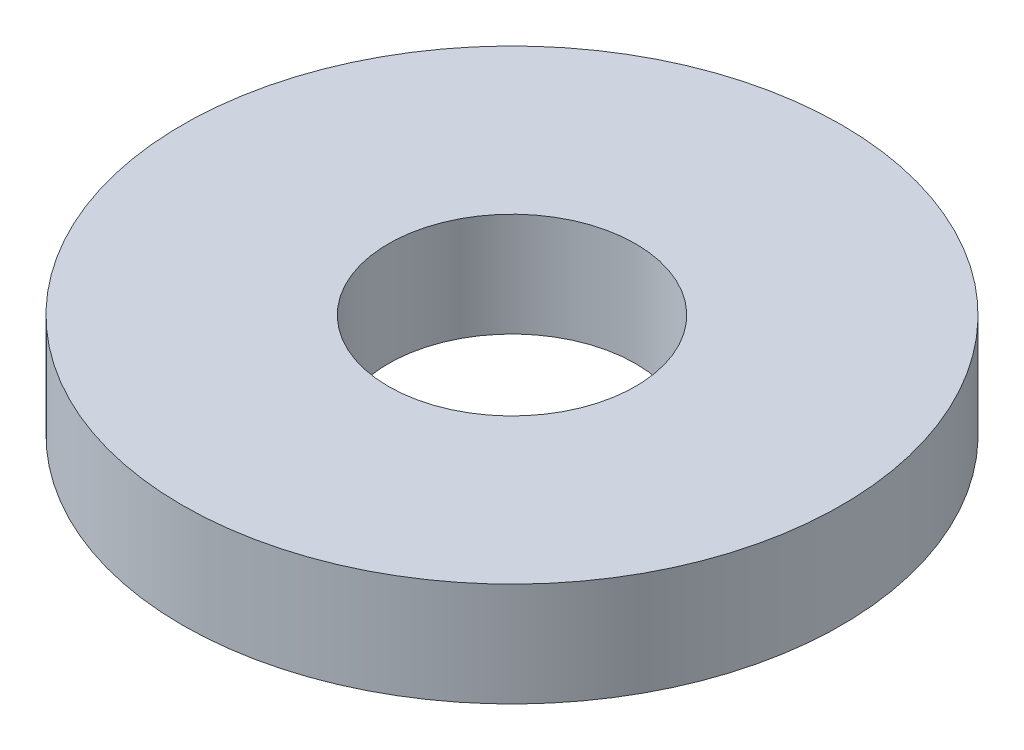
ISO-10303-21;
HEADER;
FILE_DESCRIPTION(('STEP AP214'),'2;1');
FILE_NAME('part.step','',(''),(''),'','','');
FILE_SCHEMA(('AUTOMOTIVE_DESIGN { 1 0 10303 214 1 1 1 1 }'));
ENDSEC;
DATA;
#1=APPLICATION_CONTEXT('core data for automotive mechanical design processes');
#2=APPLICATION_PROTOCOL_DEFINITION('international standard','automotive_design',2000,#1);
#3=PRODUCT_CONTEXT('',#1,'mechanical');
#4=PRODUCT('Part','Part','',(#3));
#5=PRODUCT_RELATED_PRODUCT_CATEGORY('part','',(#4));
#6=PRODUCT_DEFINITION_FORMATION('','',#4);
#7=PRODUCT_DEFINITION_CONTEXT('part definition',#1,'design');
#8=PRODUCT_DEFINITION('design','',#6,#7);
#9=PRODUCT_DEFINITION_SHAPE('','',#8);
#10=(LENGTH_UNIT() NAMED_UNIT(*) SI_UNIT(.MILLI.,.METRE.));
#11=(NAMED_UNIT(*) PLANE_ANGLE_UNIT() SI_UNIT($,.RADIAN.));
#12=(NAMED_UNIT(*) SI_UNIT($,.STERADIAN.) SOLID_ANGLE_UNIT());
#13=UNCERTAINTY_MEASURE_WITH_UNIT(LENGTH_MEASURE(1.E-05),#10,'distance_accuracy_value','');
#14=(GEOMETRIC_REPRESENTATION_CONTEXT(3) GLOBAL_UNCERTAINTY_ASSIGNED_CONTEXT((#13)) GLOBAL_UNIT_ASSIGNED_CONTEXT((#10,
#11,#12)) REPRESENTATION_CONTEXT('',''));
#15=CARTESIAN_POINT('',(0.,0.,0.));
#16=DIRECTION('',(0.,0.,1.));
#17=DIRECTION('',(1.,0.,0.));
#18=AXIS2_PLACEMENT_3D('',#15,#16,#17);
#19=CARTESIAN_POINT('',(0.,3.99999999999959,4.44089209850063E-13));
#20=DIRECTION('',(0.,0.999999999999999,0.));
#21=DIRECTION('',(0.,0.,1.));
#22=AXIS2_PLACEMENT_3D('',#19,#20,#21);
#23=PLANE('',#22);
#24=CARTESIAN_POINT('',(0.,3.99999999999959,4.44089209850063E-13));
#25=DIRECTION('',(0.,0.999999999999999,0.));
#26=DIRECTION('',(0.,0.,1.));
#27=AXIS2_PLACEMENT_3D('',#24,#25,#26);
#28=CIRCLE('',#27,12.7);
#29=CARTESIAN_POINT('',(0.,3.99999999999959,12.7000000000004));
#30=VERTEX_POINT('',#29);
#31=EDGE_CURVE('E10',#30,#30,#28,.T.);
#32=ORIENTED_EDGE('',*,*,#31,.T.);
#33=EDGE_LOOP('',(#32));
#34=FACE_BOUND('',#33,.T.);
#35=CARTESIAN_POINT('',(0.,3.99999999999959,4.44089209850063E-13));
#36=DIRECTION('',(0.,0.999999999999999,0.));
#37=DIRECTION('',(0.,0.,1.));
#38=AXIS2_PLACEMENT_3D('',#35,#36,#37);
#39=CIRCLE('',#38,4.7625);
#40=CARTESIAN_POINT('',(0.,3.99999999999959,4.76250000000044));
#41=VERTEX_POINT('',#40);
#42=EDGE_CURVE('E41',#41,#41,#39,.T.);
#43=ORIENTED_EDGE('',*,*,#42,.F.);
#44=EDGE_LOOP('',(#43));
#45=FACE_BOUND('',#44,.T.);
#46=ADVANCED_FACE('F30',(#34,#45),#23,.T.);
#47=CARTESIAN_POINT('',(0.,0.,0.));
#48=DIRECTION('',(0.,0.999999999999999,0.));
#49=DIRECTION('',(0.,0.,1.));
#50=AXIS2_PLACEMENT_3D('',#47,#48,#49);
#51=PLANE('',#50);
#52=CARTESIAN_POINT('',(0.,0.,0.));
#53=DIRECTION('',(0.,0.999999999999999,0.));
#54=DIRECTION('',(0.,0.,1.));
#55=AXIS2_PLACEMENT_3D('',#52,#53,#54);
#56=CIRCLE('',#55,12.7);
#57=CARTESIAN_POINT('',(0.,0.,12.7));
#58=VERTEX_POINT('',#57);
#59=EDGE_CURVE('E34',#58,#58,#56,.T.);
#60=ORIENTED_EDGE('',*,*,#59,.F.);
#61=EDGE_LOOP('',(#60));
#62=FACE_BOUND('',#61,.T.);
#63=CARTESIAN_POINT('',(0.,0.,0.));
#64=DIRECTION('',(0.,0.999999999999999,0.));
#65=DIRECTION('',(0.,0.,1.));
#66=AXIS2_PLACEMENT_3D('',#63,#64,#65);
#67=CIRCLE('',#66,4.7625);
#68=CARTESIAN_POINT('',(0.,0.,4.7625));
#69=VERTEX_POINT('',#68);
#70=EDGE_CURVE('E43',#69,#69,#67,.T.);
#71=ORIENTED_EDGE('',*,*,#70,.T.);
#72=EDGE_LOOP('',(#71));
#73=FACE_BOUND('',#72,.T.);
#74=ADVANCED_FACE('F53',(#62,#73),#51,.F.);
#75=CARTESIAN_POINT('',(0.,3.99999999999959,4.44089209850063E-13));
#76=DIRECTION('',(0.,-0.999999999999999,0.));
#77=DIRECTION('',(0.,0.,-1.));
#78=AXIS2_PLACEMENT_3D('',#75,#76,#77);
#79=CYLINDRICAL_SURFACE('',#78,12.7);
#80=ORIENTED_EDGE('',*,*,#31,.F.);
#81=EDGE_LOOP('',(#80));
#82=FACE_BOUND('',#81,.T.);
#83=ORIENTED_EDGE('',*,*,#59,.T.);
#84=EDGE_LOOP('',(#83));
#85=FACE_BOUND('',#84,.T.);
#86=ADVANCED_FACE('F32',(#82,#85),#79,.T.);
#87=CARTESIAN_POINT('',(0.,3.99999999999959,4.44089209850063E-13));
#88=DIRECTION('',(0.,-0.999999999999999,0.));
#89=DIRECTION('',(0.,0.,-1.));
#90=AXIS2_PLACEMENT_3D('',#87,#88,#89);
#91=CYLINDRICAL_SURFACE('',#90,4.7625);
#92=ORIENTED_EDGE('',*,*,#42,.T.);
#93=EDGE_LOOP('',(#92));
#94=FACE_BOUND('',#93,.T.);
#95=ORIENTED_EDGE('',*,*,#70,.F.);
#96=EDGE_LOOP('',(#95));
#97=FACE_BOUND('',#96,.T.);
#98=ADVANCED_FACE('F49',(#94,#97),#91,.F.);
#99=CLOSED_SHELL('',(#46,#74,#86,#98));
#100=MANIFOLD_SOLID_BREP('B2',#99);
#101=ADVANCED_BREP_SHAPE_REPRESENTATION('',(#18,#100),#14);
#102=SHAPE_DEFINITION_REPRESENTATION(#9,#101);
ENDSEC;
END-ISO-10303-21;
